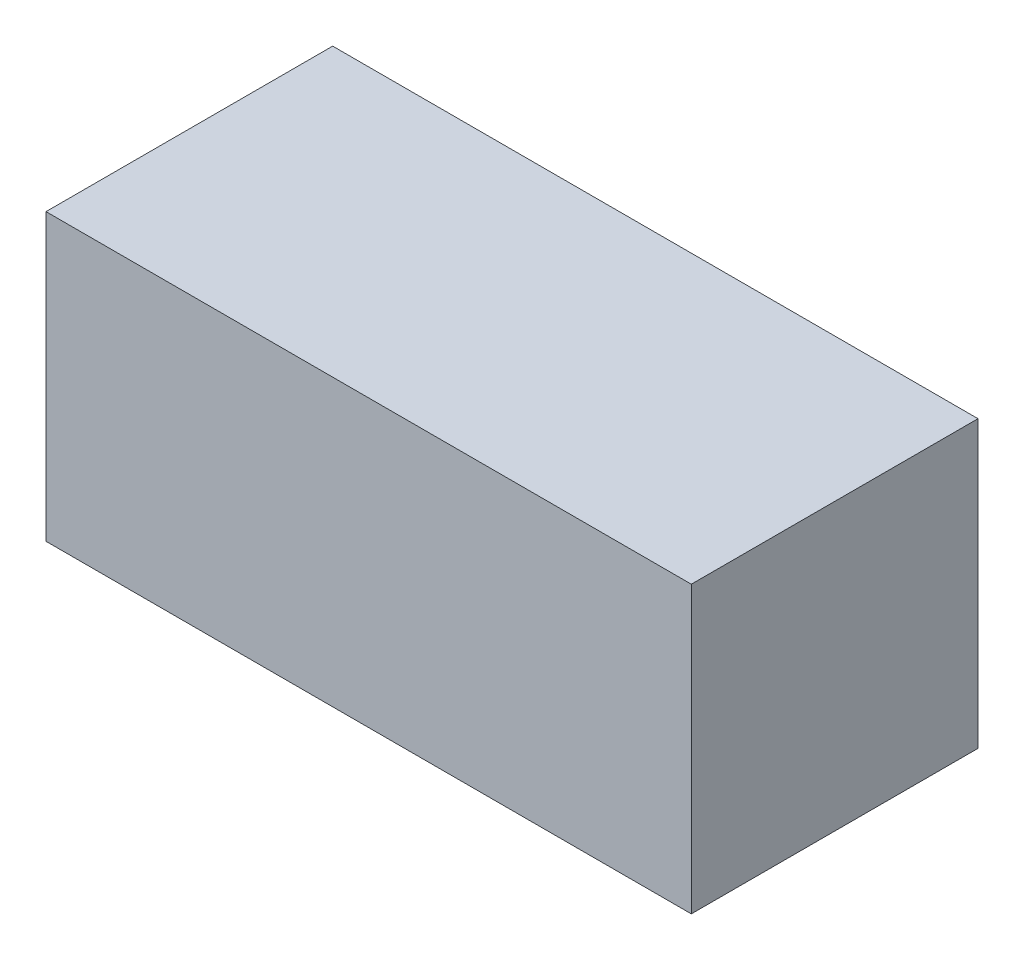
ISO-10303-21;
HEADER;
FILE_DESCRIPTION(('STEP AP214'),'2;1');
FILE_NAME('part.step','',(''),(''),'','','');
FILE_SCHEMA(('AUTOMOTIVE_DESIGN { 1 0 10303 214 1 1 1 1 }'));
ENDSEC;
DATA;
#1=APPLICATION_CONTEXT('core data for automotive mechanical design processes');
#2=APPLICATION_PROTOCOL_DEFINITION('international standard','automotive_design',2000,#1);
#3=PRODUCT_CONTEXT('',#1,'mechanical');
#4=PRODUCT('Part','Part','',(#3));
#5=PRODUCT_RELATED_PRODUCT_CATEGORY('part','',(#4));
#6=PRODUCT_DEFINITION_FORMATION('','',#4);
#7=PRODUCT_DEFINITION_CONTEXT('part definition',#1,'design');
#8=PRODUCT_DEFINITION('design','',#6,#7);
#9=PRODUCT_DEFINITION_SHAPE('','',#8);
#10=(LENGTH_UNIT() NAMED_UNIT(*) SI_UNIT(.MILLI.,.METRE.));
#11=(NAMED_UNIT(*) PLANE_ANGLE_UNIT() SI_UNIT($,.RADIAN.));
#12=(NAMED_UNIT(*) SI_UNIT($,.STERADIAN.) SOLID_ANGLE_UNIT());
#13=UNCERTAINTY_MEASURE_WITH_UNIT(LENGTH_MEASURE(1.E-05),#10,'distance_accuracy_value','');
#14=(GEOMETRIC_REPRESENTATION_CONTEXT(3) GLOBAL_UNCERTAINTY_ASSIGNED_CONTEXT((#13)) GLOBAL_UNIT_ASSIGNED_CONTEXT((#10,
#11,#12)) REPRESENTATION_CONTEXT('',''));
#15=CARTESIAN_POINT('',(0.,0.,0.));
#16=DIRECTION('',(0.,0.,1.));
#17=DIRECTION('',(1.,0.,0.));
#18=AXIS2_PLACEMENT_3D('',#15,#16,#17);
#19=CARTESIAN_POINT('',(-1.61255,2.88795,0.));
#20=DIRECTION('',(1.,0.,0.));
#21=DIRECTION('',(0.,0.,1.));
#22=AXIS2_PLACEMENT_3D('',#19,#20,#21);
#23=PLANE('',#22);
#24=DIRECTION('',(0.,1.,0.));
#25=VECTOR('',#24,1.);
#26=CARTESIAN_POINT('',(-1.61255,2.88795,0.1));
#27=LINE('',#26,#25);
#28=CARTESIAN_POINT('',(-1.61255,2.88795,0.1));
#29=VERTEX_POINT('',#28);
#30=CARTESIAN_POINT('',(-1.61255,2.98755,0.1));
#31=VERTEX_POINT('',#30);
#32=EDGE_CURVE('E11',#29,#31,#27,.T.);
#33=ORIENTED_EDGE('',*,*,#32,.T.);
#34=DIRECTION('',(0.,0.,1.));
#35=VECTOR('',#34,1.);
#36=CARTESIAN_POINT('',(-1.61255,2.98755,0.));
#37=LINE('',#36,#35);
#38=CARTESIAN_POINT('',(-1.61255,2.98755,0.));
#39=VERTEX_POINT('',#38);
#40=EDGE_CURVE('E24',#39,#31,#37,.T.);
#41=ORIENTED_EDGE('',*,*,#40,.F.);
#42=DIRECTION('',(0.,1.,0.));
#43=VECTOR('',#42,1.);
#44=CARTESIAN_POINT('',(-1.61255,2.88795,0.));
#45=LINE('',#44,#43);
#46=CARTESIAN_POINT('',(-1.61255,2.88795,0.));
#47=VERTEX_POINT('',#46);
#48=EDGE_CURVE('E86',#47,#39,#45,.T.);
#49=ORIENTED_EDGE('',*,*,#48,.F.);
#50=DIRECTION('',(0.,0.,1.));
#51=VECTOR('',#50,1.);
#52=CARTESIAN_POINT('',(-1.61255,2.88795,0.));
#53=LINE('',#52,#51);
#54=EDGE_CURVE('E36',#47,#29,#53,.T.);
#55=ORIENTED_EDGE('',*,*,#54,.T.);
#56=EDGE_LOOP('',(#33,#41,#49,#55));
#57=FACE_BOUND('',#56,.T.);
#58=ADVANCED_FACE('F17',(#57),#23,.F.);
#59=CARTESIAN_POINT('',(-1.38745,2.88795,0.));
#60=DIRECTION('',(1.,0.,0.));
#61=DIRECTION('',(0.,0.,1.));
#62=AXIS2_PLACEMENT_3D('',#59,#60,#61);
#63=PLANE('',#62);
#64=DIRECTION('',(0.,0.,1.));
#65=VECTOR('',#64,1.);
#66=CARTESIAN_POINT('',(-1.38745,2.88795,0.));
#67=LINE('',#66,#65);
#68=CARTESIAN_POINT('',(-1.38745,2.88795,0.));
#69=VERTEX_POINT('',#68);
#70=CARTESIAN_POINT('',(-1.38745,2.88795,0.1));
#71=VERTEX_POINT('',#70);
#72=EDGE_CURVE('E83',#69,#71,#67,.T.);
#73=ORIENTED_EDGE('',*,*,#72,.F.);
#74=DIRECTION('',(0.,1.,0.));
#75=VECTOR('',#74,1.);
#76=CARTESIAN_POINT('',(-1.38745,2.88795,0.));
#77=LINE('',#76,#75);
#78=CARTESIAN_POINT('',(-1.38745,2.98755,0.));
#79=VERTEX_POINT('',#78);
#80=EDGE_CURVE('E63',#69,#79,#77,.T.);
#81=ORIENTED_EDGE('',*,*,#80,.T.);
#82=DIRECTION('',(0.,0.,1.));
#83=VECTOR('',#82,1.);
#84=CARTESIAN_POINT('',(-1.38745,2.98755,0.));
#85=LINE('',#84,#83);
#86=CARTESIAN_POINT('',(-1.38745,2.98755,0.1));
#87=VERTEX_POINT('',#86);
#88=EDGE_CURVE('E57',#79,#87,#85,.T.);
#89=ORIENTED_EDGE('',*,*,#88,.T.);
#90=DIRECTION('',(0.,1.,0.));
#91=VECTOR('',#90,1.);
#92=CARTESIAN_POINT('',(-1.38745,2.88795,0.1));
#93=LINE('',#92,#91);
#94=EDGE_CURVE('E60',#71,#87,#93,.T.);
#95=ORIENTED_EDGE('',*,*,#94,.F.);
#96=EDGE_LOOP('',(#73,#81,#89,#95));
#97=FACE_BOUND('',#96,.T.);
#98=ADVANCED_FACE('F59',(#97),#63,.T.);
#99=CARTESIAN_POINT('',(-1.61255,2.88795,0.));
#100=DIRECTION('',(0.,1.,0.));
#101=DIRECTION('',(0.,0.,1.));
#102=AXIS2_PLACEMENT_3D('',#99,#100,#101);
#103=PLANE('',#102);
#104=ORIENTED_EDGE('',*,*,#72,.T.);
#105=DIRECTION('',(1.,0.,0.));
#106=VECTOR('',#105,1.);
#107=CARTESIAN_POINT('',(-1.61255,2.88795,0.1));
#108=LINE('',#107,#106);
#109=EDGE_CURVE('E71',#29,#71,#108,.T.);
#110=ORIENTED_EDGE('',*,*,#109,.F.);
#111=ORIENTED_EDGE('',*,*,#54,.F.);
#112=DIRECTION('',(1.,0.,0.));
#113=VECTOR('',#112,1.);
#114=CARTESIAN_POINT('',(-1.61255,2.88795,0.));
#115=LINE('',#114,#113);
#116=EDGE_CURVE('E76',#47,#69,#115,.T.);
#117=ORIENTED_EDGE('',*,*,#116,.T.);
#118=EDGE_LOOP('',(#104,#110,#111,#117));
#119=FACE_BOUND('',#118,.T.);
#120=ADVANCED_FACE('F91',(#119),#103,.F.);
#121=CARTESIAN_POINT('',(-1.61255,2.98755,0.));
#122=DIRECTION('',(0.,1.,0.));
#123=DIRECTION('',(0.,0.,1.));
#124=AXIS2_PLACEMENT_3D('',#121,#122,#123);
#125=PLANE('',#124);
#126=DIRECTION('',(1.,0.,0.));
#127=VECTOR('',#126,1.);
#128=CARTESIAN_POINT('',(-1.61255,2.98755,0.));
#129=LINE('',#128,#127);
#130=EDGE_CURVE('E74',#39,#79,#129,.T.);
#131=ORIENTED_EDGE('',*,*,#130,.F.);
#132=ORIENTED_EDGE('',*,*,#40,.T.);
#133=DIRECTION('',(1.,0.,0.));
#134=VECTOR('',#133,1.);
#135=CARTESIAN_POINT('',(-1.61255,2.98755,0.1));
#136=LINE('',#135,#134);
#137=EDGE_CURVE('E69',#31,#87,#136,.T.);
#138=ORIENTED_EDGE('',*,*,#137,.T.);
#139=ORIENTED_EDGE('',*,*,#88,.F.);
#140=EDGE_LOOP('',(#131,#132,#138,#139));
#141=FACE_BOUND('',#140,.T.);
#142=ADVANCED_FACE('F73',(#141),#125,.T.);
#143=CARTESIAN_POINT('',(-1.61255,2.88795,0.));
#144=DIRECTION('',(0.,0.,1.));
#145=DIRECTION('',(1.,0.,0.));
#146=AXIS2_PLACEMENT_3D('',#143,#144,#145);
#147=PLANE('',#146);
#148=ORIENTED_EDGE('',*,*,#130,.T.);
#149=ORIENTED_EDGE('',*,*,#80,.F.);
#150=ORIENTED_EDGE('',*,*,#116,.F.);
#151=ORIENTED_EDGE('',*,*,#48,.T.);
#152=EDGE_LOOP('',(#148,#149,#150,#151));
#153=FACE_BOUND('',#152,.T.);
#154=ADVANCED_FACE('F89',(#153),#147,.F.);
#155=CARTESIAN_POINT('',(-1.61255,2.88795,0.1));
#156=DIRECTION('',(0.,0.,1.));
#157=DIRECTION('',(1.,0.,0.));
#158=AXIS2_PLACEMENT_3D('',#155,#156,#157);
#159=PLANE('',#158);
#160=ORIENTED_EDGE('',*,*,#32,.F.);
#161=ORIENTED_EDGE('',*,*,#109,.T.);
#162=ORIENTED_EDGE('',*,*,#94,.T.);
#163=ORIENTED_EDGE('',*,*,#137,.F.);
#164=EDGE_LOOP('',(#160,#161,#162,#163));
#165=FACE_BOUND('',#164,.T.);
#166=ADVANCED_FACE('F68',(#165),#159,.T.);
#167=CLOSED_SHELL('',(#58,#98,#120,#142,#154,#166));
#168=MANIFOLD_SOLID_BREP('B1',#167);
#169=ADVANCED_BREP_SHAPE_REPRESENTATION('',(#18,#168),#14);
#170=SHAPE_DEFINITION_REPRESENTATION(#9,#169);
ENDSEC;
END-ISO-10303-21;
